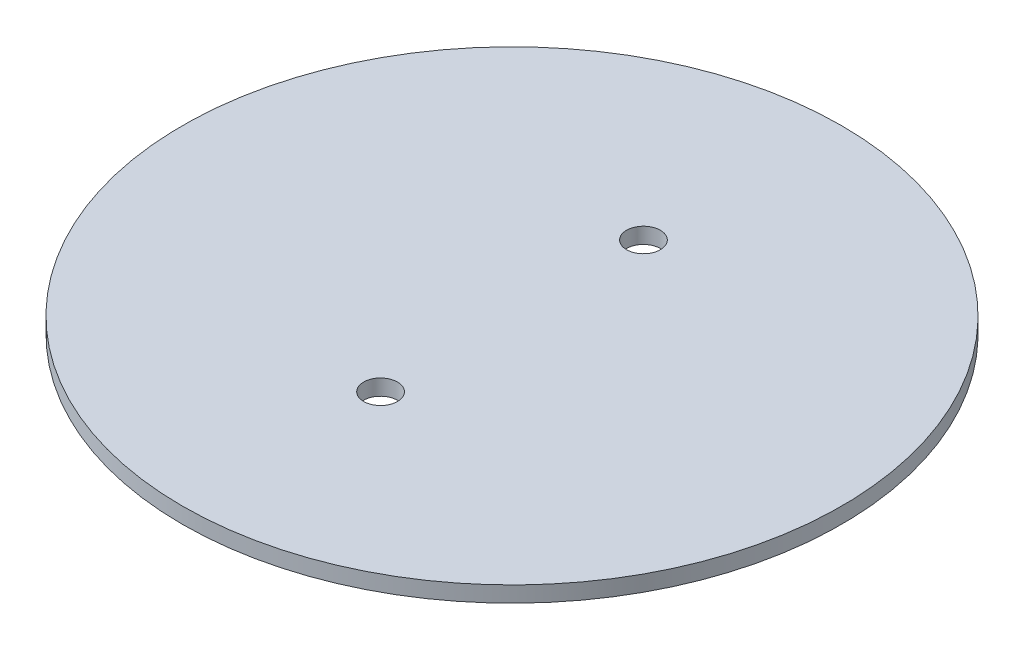
ISO-10303-21;
HEADER;
FILE_DESCRIPTION(('STEP AP214'),'2;1');
FILE_NAME('part.step','',(''),(''),'','','');
FILE_SCHEMA(('AUTOMOTIVE_DESIGN { 1 0 10303 214 1 1 1 1 }'));
ENDSEC;
DATA;
#1=APPLICATION_CONTEXT('core data for automotive mechanical design processes');
#2=APPLICATION_PROTOCOL_DEFINITION('international standard','automotive_design',2000,#1);
#3=PRODUCT_CONTEXT('',#1,'mechanical');
#4=PRODUCT('Part','Part','',(#3));
#5=PRODUCT_RELATED_PRODUCT_CATEGORY('part','',(#4));
#6=PRODUCT_DEFINITION_FORMATION('','',#4);
#7=PRODUCT_DEFINITION_CONTEXT('part definition',#1,'design');
#8=PRODUCT_DEFINITION('design','',#6,#7);
#9=PRODUCT_DEFINITION_SHAPE('','',#8);
#10=(LENGTH_UNIT() NAMED_UNIT(*) SI_UNIT(.MILLI.,.METRE.));
#11=(NAMED_UNIT(*) PLANE_ANGLE_UNIT() SI_UNIT($,.RADIAN.));
#12=(NAMED_UNIT(*) SI_UNIT($,.STERADIAN.) SOLID_ANGLE_UNIT());
#13=UNCERTAINTY_MEASURE_WITH_UNIT(LENGTH_MEASURE(1.E-05),#10,'distance_accuracy_value','');
#14=(GEOMETRIC_REPRESENTATION_CONTEXT(3) GLOBAL_UNCERTAINTY_ASSIGNED_CONTEXT((#13)) GLOBAL_UNIT_ASSIGNED_CONTEXT((#10,
#11,#12)) REPRESENTATION_CONTEXT('',''));
#15=CARTESIAN_POINT('',(0.,0.,0.));
#16=DIRECTION('',(0.,0.,1.));
#17=DIRECTION('',(1.,0.,0.));
#18=AXIS2_PLACEMENT_3D('',#15,#16,#17);
#19=CARTESIAN_POINT('',(0.,3.,0.));
#20=DIRECTION('',(0.,-1.,0.));
#21=DIRECTION('',(0.,0.,-1.));
#22=AXIS2_PLACEMENT_3D('',#19,#20,#21);
#23=CYLINDRICAL_SURFACE('',#22,62.5);
#24=CARTESIAN_POINT('',(0.,3.,0.));
#25=DIRECTION('',(0.,1.,0.));
#26=DIRECTION('',(0.,0.,1.));
#27=AXIS2_PLACEMENT_3D('',#24,#25,#26);
#28=CIRCLE('',#27,62.5);
#29=CARTESIAN_POINT('',(0.,3.,62.5));
#30=VERTEX_POINT('',#29);
#31=EDGE_CURVE('E10',#30,#30,#28,.T.);
#32=ORIENTED_EDGE('',*,*,#31,.F.);
#33=EDGE_LOOP('',(#32));
#34=FACE_BOUND('',#33,.T.);
#35=CARTESIAN_POINT('',(0.,0.,0.));
#36=DIRECTION('',(0.,1.,0.));
#37=DIRECTION('',(0.,0.,1.));
#38=AXIS2_PLACEMENT_3D('',#35,#36,#37);
#39=CIRCLE('',#38,62.5);
#40=CARTESIAN_POINT('',(0.,0.,62.5));
#41=VERTEX_POINT('',#40);
#42=EDGE_CURVE('E34',#41,#41,#39,.T.);
#43=ORIENTED_EDGE('',*,*,#42,.T.);
#44=EDGE_LOOP('',(#43));
#45=FACE_BOUND('',#44,.T.);
#46=ADVANCED_FACE('F31',(#34,#45),#23,.T.);
#47=CARTESIAN_POINT('',(0.,3.,0.));
#48=DIRECTION('',(0.,1.,0.));
#49=DIRECTION('',(0.,0.,1.));
#50=AXIS2_PLACEMENT_3D('',#47,#48,#49);
#51=PLANE('',#50);
#52=CARTESIAN_POINT('',(0.,3.,-24.9282519893654));
#53=DIRECTION('',(0.,1.,0.));
#54=DIRECTION('',(0.,0.,1.));
#55=AXIS2_PLACEMENT_3D('',#52,#53,#54);
#56=CIRCLE('',#55,3.20347648148003);
#57=CARTESIAN_POINT('',(0.,3.,-21.7247755078854));
#58=VERTEX_POINT('',#57);
#59=EDGE_CURVE('E49',#58,#58,#56,.T.);
#60=ORIENTED_EDGE('',*,*,#59,.F.);
#61=EDGE_LOOP('',(#60));
#62=FACE_BOUND('',#61,.T.);
#63=CARTESIAN_POINT('',(0.,3.,24.9282519893654));
#64=DIRECTION('',(0.,1.,0.));
#65=DIRECTION('',(0.,0.,-1.));
#66=AXIS2_PLACEMENT_3D('',#63,#64,#65);
#67=CIRCLE('',#66,3.20347648148003);
#68=CARTESIAN_POINT('',(0.,3.,21.7247755078854));
#69=VERTEX_POINT('',#68);
#70=EDGE_CURVE('E43',#69,#69,#67,.T.);
#71=ORIENTED_EDGE('',*,*,#70,.F.);
#72=EDGE_LOOP('',(#71));
#73=FACE_BOUND('',#72,.T.);
#74=ORIENTED_EDGE('',*,*,#31,.T.);
#75=EDGE_LOOP('',(#74));
#76=FACE_BOUND('',#75,.T.);
#77=ADVANCED_FACE('F65',(#62,#73,#76),#51,.T.);
#78=CARTESIAN_POINT('',(0.,0.,0.));
#79=DIRECTION('',(0.,1.,0.));
#80=DIRECTION('',(0.,0.,1.));
#81=AXIS2_PLACEMENT_3D('',#78,#79,#80);
#82=PLANE('',#81);
#83=CARTESIAN_POINT('',(0.,0.,-24.9282519893654));
#84=DIRECTION('',(0.,1.,0.));
#85=DIRECTION('',(0.,0.,1.));
#86=AXIS2_PLACEMENT_3D('',#83,#84,#85);
#87=CIRCLE('',#86,3.20347648148003);
#88=CARTESIAN_POINT('',(0.,0.,-21.7247755078854));
#89=VERTEX_POINT('',#88);
#90=EDGE_CURVE('E41',#89,#89,#87,.T.);
#91=ORIENTED_EDGE('',*,*,#90,.T.);
#92=EDGE_LOOP('',(#91));
#93=FACE_BOUND('',#92,.T.);
#94=CARTESIAN_POINT('',(0.,0.,24.9282519893654));
#95=DIRECTION('',(0.,1.,0.));
#96=DIRECTION('',(0.,0.,-1.));
#97=AXIS2_PLACEMENT_3D('',#94,#95,#96);
#98=CIRCLE('',#97,3.20347648148003);
#99=CARTESIAN_POINT('',(0.,0.,21.7247755078854));
#100=VERTEX_POINT('',#99);
#101=EDGE_CURVE('E46',#100,#100,#98,.T.);
#102=ORIENTED_EDGE('',*,*,#101,.T.);
#103=EDGE_LOOP('',(#102));
#104=FACE_BOUND('',#103,.T.);
#105=ORIENTED_EDGE('',*,*,#42,.F.);
#106=EDGE_LOOP('',(#105));
#107=FACE_BOUND('',#106,.T.);
#108=ADVANCED_FACE('F55',(#93,#104,#107),#82,.F.);
#109=CARTESIAN_POINT('',(0.,0.,24.9282519893654));
#110=DIRECTION('',(0.,1.,0.));
#111=DIRECTION('',(0.,0.,1.));
#112=AXIS2_PLACEMENT_3D('',#109,#110,#111);
#113=CYLINDRICAL_SURFACE('',#112,3.20347648148003);
#114=ORIENTED_EDGE('',*,*,#101,.F.);
#115=EDGE_LOOP('',(#114));
#116=FACE_BOUND('',#115,.T.);
#117=ORIENTED_EDGE('',*,*,#70,.T.);
#118=EDGE_LOOP('',(#117));
#119=FACE_BOUND('',#118,.T.);
#120=ADVANCED_FACE('F61',(#116,#119),#113,.F.);
#121=CARTESIAN_POINT('',(0.,0.,-24.9282519893654));
#122=DIRECTION('',(0.,1.,0.));
#123=DIRECTION('',(0.,0.,1.));
#124=AXIS2_PLACEMENT_3D('',#121,#122,#123);
#125=CYLINDRICAL_SURFACE('',#124,3.20347648148003);
#126=ORIENTED_EDGE('',*,*,#90,.F.);
#127=EDGE_LOOP('',(#126));
#128=FACE_BOUND('',#127,.T.);
#129=ORIENTED_EDGE('',*,*,#59,.T.);
#130=EDGE_LOOP('',(#129));
#131=FACE_BOUND('',#130,.T.);
#132=ADVANCED_FACE('F58',(#128,#131),#125,.F.);
#133=CLOSED_SHELL('',(#46,#77,#108,#120,#132));
#134=MANIFOLD_SOLID_BREP('B2',#133);
#135=ADVANCED_BREP_SHAPE_REPRESENTATION('',(#18,#134),#14);
#136=SHAPE_DEFINITION_REPRESENTATION(#9,#135);
ENDSEC;
END-ISO-10303-21;
